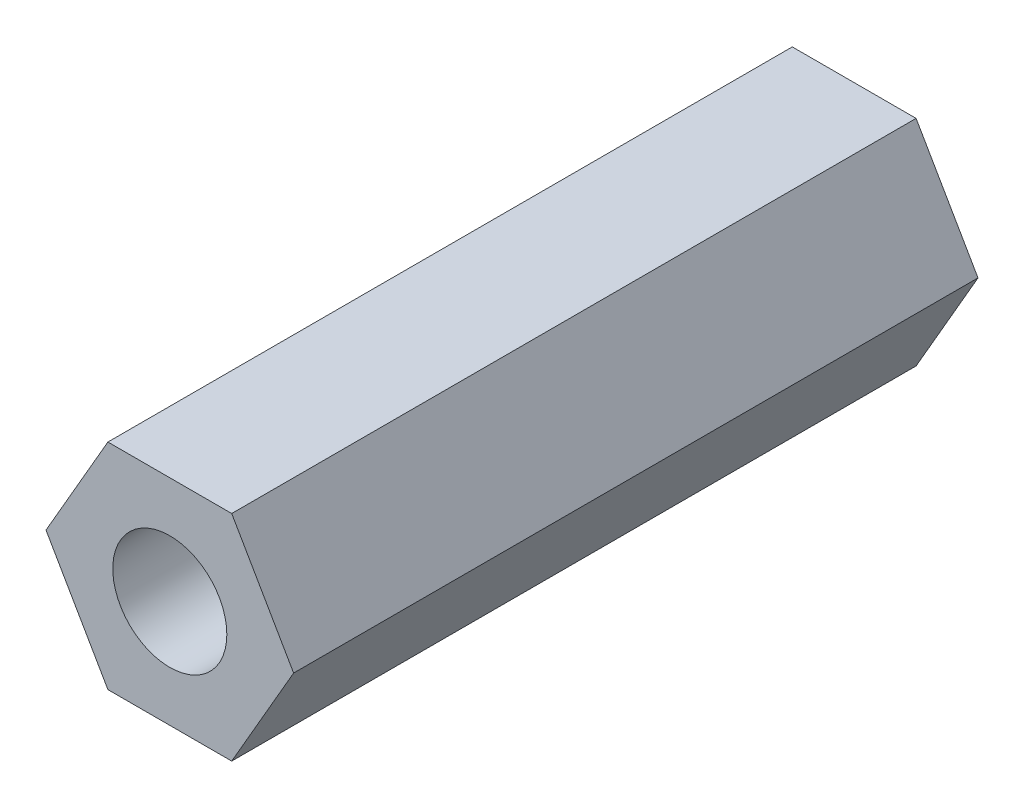
ISO-10303-21;
HEADER;
FILE_DESCRIPTION(('STEP AP214'),'2;1');
FILE_NAME('part.step','',(''),(''),'','','');
FILE_SCHEMA(('AUTOMOTIVE_DESIGN { 1 0 10303 214 1 1 1 1 }'));
ENDSEC;
DATA;
#1=APPLICATION_CONTEXT('core data for automotive mechanical design processes');
#2=APPLICATION_PROTOCOL_DEFINITION('international standard','automotive_design',2000,#1);
#3=PRODUCT_CONTEXT('',#1,'mechanical');
#4=PRODUCT('Part','Part','',(#3));
#5=PRODUCT_RELATED_PRODUCT_CATEGORY('part','',(#4));
#6=PRODUCT_DEFINITION_FORMATION('','',#4);
#7=PRODUCT_DEFINITION_CONTEXT('part definition',#1,'design');
#8=PRODUCT_DEFINITION('design','',#6,#7);
#9=PRODUCT_DEFINITION_SHAPE('','',#8);
#10=(LENGTH_UNIT() NAMED_UNIT(*) SI_UNIT(.MILLI.,.METRE.));
#11=(NAMED_UNIT(*) PLANE_ANGLE_UNIT() SI_UNIT($,.RADIAN.));
#12=(NAMED_UNIT(*) SI_UNIT($,.STERADIAN.) SOLID_ANGLE_UNIT());
#13=UNCERTAINTY_MEASURE_WITH_UNIT(LENGTH_MEASURE(1.E-05),#10,'distance_accuracy_value','');
#14=(GEOMETRIC_REPRESENTATION_CONTEXT(3) GLOBAL_UNCERTAINTY_ASSIGNED_CONTEXT((#13)) GLOBAL_UNIT_ASSIGNED_CONTEXT((#10,
#11,#12)) REPRESENTATION_CONTEXT('',''));
#15=CARTESIAN_POINT('',(0.,0.,0.));
#16=DIRECTION('',(0.,0.,1.));
#17=DIRECTION('',(1.,0.,0.));
#18=AXIS2_PLACEMENT_3D('',#15,#16,#17);
#19=CARTESIAN_POINT('',(0.,0.,-7.5));
#20=DIRECTION('',(0.,0.,1.));
#21=DIRECTION('',(1.,0.,0.));
#22=AXIS2_PLACEMENT_3D('',#19,#20,#21);
#23=PLANE('',#22);
#24=DIRECTION('',(-0.5,0.866025403784438,0.));
#25=VECTOR('',#24,1.);
#26=CARTESIAN_POINT('',(2.71354626519124,0.,-7.5));
#27=LINE('',#26,#25);
#28=CARTESIAN_POINT('',(2.71354626519124,0.,-7.5));
#29=VERTEX_POINT('',#28);
#30=CARTESIAN_POINT('',(1.35677313259562,2.35,-7.5));
#31=VERTEX_POINT('',#30);
#32=EDGE_CURVE('E125',#29,#31,#27,.T.);
#33=ORIENTED_EDGE('',*,*,#32,.F.);
#34=DIRECTION('',(0.5,0.866025403784439,0.));
#35=VECTOR('',#34,1.);
#36=CARTESIAN_POINT('',(1.35677313259562,-2.35,-7.5));
#37=LINE('',#36,#35);
#38=CARTESIAN_POINT('',(1.35677313259562,-2.35,-7.5));
#39=VERTEX_POINT('',#38);
#40=EDGE_CURVE('E86',#39,#29,#37,.T.);
#41=ORIENTED_EDGE('',*,*,#40,.F.);
#42=DIRECTION('',(1.,0.,0.));
#43=VECTOR('',#42,1.);
#44=CARTESIAN_POINT('',(-1.35677313259562,-2.35,-7.5));
#45=LINE('',#44,#43);
#46=CARTESIAN_POINT('',(-1.35677313259562,-2.35,-7.5));
#47=VERTEX_POINT('',#46);
#48=EDGE_CURVE('E80',#47,#39,#45,.T.);
#49=ORIENTED_EDGE('',*,*,#48,.F.);
#50=DIRECTION('',(0.5,-0.866025403784439,0.));
#51=VECTOR('',#50,1.);
#52=CARTESIAN_POINT('',(-2.71354626519124,0.,-7.5));
#53=LINE('',#52,#51);
#54=CARTESIAN_POINT('',(-2.71354626519124,0.,-7.5));
#55=VERTEX_POINT('',#54);
#56=EDGE_CURVE('E115',#55,#47,#53,.T.);
#57=ORIENTED_EDGE('',*,*,#56,.F.);
#58=DIRECTION('',(-0.5,-0.866025403784439,0.));
#59=VECTOR('',#58,1.);
#60=CARTESIAN_POINT('',(-1.35677313259562,2.35,-7.5));
#61=LINE('',#60,#59);
#62=CARTESIAN_POINT('',(-1.35677313259562,2.35,-7.5));
#63=VERTEX_POINT('',#62);
#64=EDGE_CURVE('E131',#63,#55,#61,.T.);
#65=ORIENTED_EDGE('',*,*,#64,.F.);
#66=DIRECTION('',(-1.,0.,0.));
#67=VECTOR('',#66,1.);
#68=CARTESIAN_POINT('',(1.35677313259562,2.35,-7.5));
#69=LINE('',#68,#67);
#70=EDGE_CURVE('E128',#31,#63,#69,.T.);
#71=ORIENTED_EDGE('',*,*,#70,.F.);
#72=EDGE_LOOP('',(#33,#41,#49,#57,#65,#71));
#73=FACE_BOUND('',#72,.T.);
#74=CARTESIAN_POINT('',(0.,0.,-7.5));
#75=DIRECTION('',(0.,0.,-1.));
#76=DIRECTION('',(-1.,0.,0.));
#77=AXIS2_PLACEMENT_3D('',#74,#75,#76);
#78=CIRCLE('',#77,1.25);
#79=CARTESIAN_POINT('',(-1.25,0.,-7.5));
#80=VERTEX_POINT('',#79);
#81=EDGE_CURVE('E176',#80,#80,#78,.T.);
#82=ORIENTED_EDGE('',*,*,#81,.F.);
#83=EDGE_LOOP('',(#82));
#84=FACE_BOUND('',#83,.T.);
#85=ADVANCED_FACE('F40',(#73,#84),#23,.F.);
#86=CARTESIAN_POINT('',(2.71354626519124,0.,7.5));
#87=DIRECTION('',(-0.866025403784438,-0.5,0.));
#88=DIRECTION('',(0.5,-0.866025403784439,0.));
#89=AXIS2_PLACEMENT_3D('',#86,#87,#88);
#90=PLANE('',#89);
#91=ORIENTED_EDGE('',*,*,#32,.T.);
#92=DIRECTION('',(0.,0.,-1.));
#93=VECTOR('',#92,1.);
#94=CARTESIAN_POINT('',(1.35677313259562,2.35,7.5));
#95=LINE('',#94,#93);
#96=CARTESIAN_POINT('',(1.35677313259562,2.35,7.5));
#97=VERTEX_POINT('',#96);
#98=EDGE_CURVE('E11',#97,#31,#95,.T.);
#99=ORIENTED_EDGE('',*,*,#98,.F.);
#100=DIRECTION('',(-0.5,0.866025403784438,0.));
#101=VECTOR('',#100,1.);
#102=CARTESIAN_POINT('',(2.71354626519124,0.,7.5));
#103=LINE('',#102,#101);
#104=CARTESIAN_POINT('',(2.71354626519124,0.,7.5));
#105=VERTEX_POINT('',#104);
#106=EDGE_CURVE('E136',#105,#97,#103,.T.);
#107=ORIENTED_EDGE('',*,*,#106,.F.);
#108=DIRECTION('',(0.,0.,-1.));
#109=VECTOR('',#108,1.);
#110=CARTESIAN_POINT('',(2.71354626519124,0.,7.5));
#111=LINE('',#110,#109);
#112=EDGE_CURVE('E121',#105,#29,#111,.T.);
#113=ORIENTED_EDGE('',*,*,#112,.T.);
#114=EDGE_LOOP('',(#91,#99,#107,#113));
#115=FACE_BOUND('',#114,.T.);
#116=ADVANCED_FACE('F42',(#115),#90,.F.);
#117=CARTESIAN_POINT('',(1.35677313259562,2.35,7.5));
#118=DIRECTION('',(0.,-1.,0.));
#119=DIRECTION('',(1.,0.,0.));
#120=AXIS2_PLACEMENT_3D('',#117,#118,#119);
#121=PLANE('',#120);
#122=ORIENTED_EDGE('',*,*,#70,.T.);
#123=DIRECTION('',(0.,0.,-1.));
#124=VECTOR('',#123,1.);
#125=CARTESIAN_POINT('',(-1.35677313259562,2.35,7.5));
#126=LINE('',#125,#124);
#127=CARTESIAN_POINT('',(-1.35677313259562,2.35,7.5));
#128=VERTEX_POINT('',#127);
#129=EDGE_CURVE('E49',#128,#63,#126,.T.);
#130=ORIENTED_EDGE('',*,*,#129,.F.);
#131=DIRECTION('',(-1.,0.,0.));
#132=VECTOR('',#131,1.);
#133=CARTESIAN_POINT('',(1.35677313259562,2.35,7.5));
#134=LINE('',#133,#132);
#135=EDGE_CURVE('E94',#97,#128,#134,.T.);
#136=ORIENTED_EDGE('',*,*,#135,.F.);
#137=ORIENTED_EDGE('',*,*,#98,.T.);
#138=EDGE_LOOP('',(#122,#130,#136,#137));
#139=FACE_BOUND('',#138,.T.);
#140=ADVANCED_FACE('F165',(#139),#121,.F.);
#141=CARTESIAN_POINT('',(-1.35677313259562,2.35,7.5));
#142=DIRECTION('',(0.866025403784439,-0.5,0.));
#143=DIRECTION('',(0.5,0.866025403784439,0.));
#144=AXIS2_PLACEMENT_3D('',#141,#142,#143);
#145=PLANE('',#144);
#146=ORIENTED_EDGE('',*,*,#64,.T.);
#147=DIRECTION('',(0.,0.,-1.));
#148=VECTOR('',#147,1.);
#149=CARTESIAN_POINT('',(-2.71354626519124,0.,7.5));
#150=LINE('',#149,#148);
#151=CARTESIAN_POINT('',(-2.71354626519124,0.,7.5));
#152=VERTEX_POINT('',#151);
#153=EDGE_CURVE('E116',#152,#55,#150,.T.);
#154=ORIENTED_EDGE('',*,*,#153,.F.);
#155=DIRECTION('',(-0.5,-0.866025403784439,0.));
#156=VECTOR('',#155,1.);
#157=CARTESIAN_POINT('',(-1.35677313259562,2.35,7.5));
#158=LINE('',#157,#156);
#159=EDGE_CURVE('E107',#128,#152,#158,.T.);
#160=ORIENTED_EDGE('',*,*,#159,.F.);
#161=ORIENTED_EDGE('',*,*,#129,.T.);
#162=EDGE_LOOP('',(#146,#154,#160,#161));
#163=FACE_BOUND('',#162,.T.);
#164=ADVANCED_FACE('F142',(#163),#145,.F.);
#165=CARTESIAN_POINT('',(-2.71354626519124,0.,7.5));
#166=DIRECTION('',(0.866025403784439,0.5,0.));
#167=DIRECTION('',(-0.5,0.866025403784439,0.));
#168=AXIS2_PLACEMENT_3D('',#165,#166,#167);
#169=PLANE('',#168);
#170=ORIENTED_EDGE('',*,*,#56,.T.);
#171=DIRECTION('',(0.,0.,-1.));
#172=VECTOR('',#171,1.);
#173=CARTESIAN_POINT('',(-1.35677313259562,-2.35,7.5));
#174=LINE('',#173,#172);
#175=CARTESIAN_POINT('',(-1.35677313259562,-2.35,7.5));
#176=VERTEX_POINT('',#175);
#177=EDGE_CURVE('E112',#176,#47,#174,.T.);
#178=ORIENTED_EDGE('',*,*,#177,.F.);
#179=DIRECTION('',(0.5,-0.866025403784439,0.));
#180=VECTOR('',#179,1.);
#181=CARTESIAN_POINT('',(-2.71354626519124,0.,7.5));
#182=LINE('',#181,#180);
#183=EDGE_CURVE('E101',#152,#176,#182,.T.);
#184=ORIENTED_EDGE('',*,*,#183,.F.);
#185=ORIENTED_EDGE('',*,*,#153,.T.);
#186=EDGE_LOOP('',(#170,#178,#184,#185));
#187=FACE_BOUND('',#186,.T.);
#188=ADVANCED_FACE('F113',(#187),#169,.F.);
#189=CARTESIAN_POINT('',(-1.35677313259562,-2.35,7.5));
#190=DIRECTION('',(0.,1.,0.));
#191=DIRECTION('',(0.,0.,1.));
#192=AXIS2_PLACEMENT_3D('',#189,#190,#191);
#193=PLANE('',#192);
#194=ORIENTED_EDGE('',*,*,#48,.T.);
#195=DIRECTION('',(0.,0.,-1.));
#196=VECTOR('',#195,1.);
#197=CARTESIAN_POINT('',(1.35677313259562,-2.35,7.5));
#198=LINE('',#197,#196);
#199=CARTESIAN_POINT('',(1.35677313259562,-2.35,7.5));
#200=VERTEX_POINT('',#199);
#201=EDGE_CURVE('E117',#200,#39,#198,.T.);
#202=ORIENTED_EDGE('',*,*,#201,.F.);
#203=DIRECTION('',(1.,0.,0.));
#204=VECTOR('',#203,1.);
#205=CARTESIAN_POINT('',(-1.35677313259562,-2.35,7.5));
#206=LINE('',#205,#204);
#207=EDGE_CURVE('E105',#176,#200,#206,.T.);
#208=ORIENTED_EDGE('',*,*,#207,.F.);
#209=ORIENTED_EDGE('',*,*,#177,.T.);
#210=EDGE_LOOP('',(#194,#202,#208,#209));
#211=FACE_BOUND('',#210,.T.);
#212=ADVANCED_FACE('F119',(#211),#193,.F.);
#213=CARTESIAN_POINT('',(1.35677313259562,-2.35,7.5));
#214=DIRECTION('',(-0.866025403784438,0.5,0.));
#215=DIRECTION('',(-0.5,-0.866025403784439,0.));
#216=AXIS2_PLACEMENT_3D('',#213,#214,#215);
#217=PLANE('',#216);
#218=ORIENTED_EDGE('',*,*,#40,.T.);
#219=ORIENTED_EDGE('',*,*,#112,.F.);
#220=DIRECTION('',(0.5,0.866025403784439,0.));
#221=VECTOR('',#220,1.);
#222=CARTESIAN_POINT('',(1.35677313259562,-2.35,7.5));
#223=LINE('',#222,#221);
#224=EDGE_CURVE('E57',#200,#105,#223,.T.);
#225=ORIENTED_EDGE('',*,*,#224,.F.);
#226=ORIENTED_EDGE('',*,*,#201,.T.);
#227=EDGE_LOOP('',(#218,#219,#225,#226));
#228=FACE_BOUND('',#227,.T.);
#229=ADVANCED_FACE('F149',(#228),#217,.F.);
#230=CARTESIAN_POINT('',(0.,0.,7.5));
#231=DIRECTION('',(0.,0.,1.));
#232=DIRECTION('',(1.,0.,0.));
#233=AXIS2_PLACEMENT_3D('',#230,#231,#232);
#234=PLANE('',#233);
#235=CARTESIAN_POINT('',(0.,0.,7.5));
#236=DIRECTION('',(0.,0.,1.));
#237=DIRECTION('',(1.,0.,0.));
#238=AXIS2_PLACEMENT_3D('',#235,#236,#237);
#239=CIRCLE('',#238,1.25);
#240=CARTESIAN_POINT('',(1.25,0.,7.5));
#241=VERTEX_POINT('',#240);
#242=EDGE_CURVE('E129',#241,#241,#239,.T.);
#243=ORIENTED_EDGE('',*,*,#242,.F.);
#244=EDGE_LOOP('',(#243));
#245=FACE_BOUND('',#244,.T.);
#246=ORIENTED_EDGE('',*,*,#106,.T.);
#247=ORIENTED_EDGE('',*,*,#135,.T.);
#248=ORIENTED_EDGE('',*,*,#159,.T.);
#249=ORIENTED_EDGE('',*,*,#183,.T.);
#250=ORIENTED_EDGE('',*,*,#207,.T.);
#251=ORIENTED_EDGE('',*,*,#224,.T.);
#252=EDGE_LOOP('',(#246,#247,#248,#249,#250,#251));
#253=FACE_BOUND('',#252,.T.);
#254=ADVANCED_FACE('F103',(#245,#253),#234,.T.);
#255=CARTESIAN_POINT('',(0.,0.,7.5));
#256=DIRECTION('',(0.,0.,1.));
#257=DIRECTION('',(1.,0.,0.));
#258=AXIS2_PLACEMENT_3D('',#255,#256,#257);
#259=CYLINDRICAL_SURFACE('',#258,1.25);
#260=ORIENTED_EDGE('',*,*,#242,.T.);
#261=EDGE_LOOP('',(#260));
#262=FACE_BOUND('',#261,.T.);
#263=ORIENTED_EDGE('',*,*,#81,.T.);
#264=EDGE_LOOP('',(#263));
#265=FACE_BOUND('',#264,.T.);
#266=ADVANCED_FACE('F156',(#262,#265),#259,.F.);
#267=CLOSED_SHELL('',(#85,#116,#140,#164,#188,#212,#229,#254,#266));
#268=MANIFOLD_SOLID_BREP('B2',#267);
#269=ADVANCED_BREP_SHAPE_REPRESENTATION('',(#18,#268),#14);
#270=SHAPE_DEFINITION_REPRESENTATION(#9,#269);
ENDSEC;
END-ISO-10303-21;
